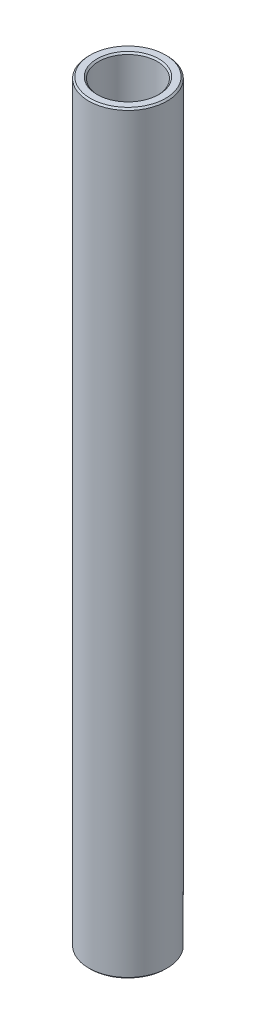
ISO-10303-21;
HEADER;
FILE_DESCRIPTION(('STEP AP214'),'2;1');
FILE_NAME('part.step','',(''),(''),'','','');
FILE_SCHEMA(('AUTOMOTIVE_DESIGN { 1 0 10303 214 1 1 1 1 }'));
ENDSEC;
DATA;
#1=APPLICATION_CONTEXT('core data for automotive mechanical design processes');
#2=APPLICATION_PROTOCOL_DEFINITION('international standard','automotive_design',2000,#1);
#3=PRODUCT_CONTEXT('',#1,'mechanical');
#4=PRODUCT('Part','Part','',(#3));
#5=PRODUCT_RELATED_PRODUCT_CATEGORY('part','',(#4));
#6=PRODUCT_DEFINITION_FORMATION('','',#4);
#7=PRODUCT_DEFINITION_CONTEXT('part definition',#1,'design');
#8=PRODUCT_DEFINITION('design','',#6,#7);
#9=PRODUCT_DEFINITION_SHAPE('','',#8);
#10=(LENGTH_UNIT() NAMED_UNIT(*) SI_UNIT(.MILLI.,.METRE.));
#11=(NAMED_UNIT(*) PLANE_ANGLE_UNIT() SI_UNIT($,.RADIAN.));
#12=(NAMED_UNIT(*) SI_UNIT($,.STERADIAN.) SOLID_ANGLE_UNIT());
#13=UNCERTAINTY_MEASURE_WITH_UNIT(LENGTH_MEASURE(1.E-05),#10,'distance_accuracy_value','');
#14=(GEOMETRIC_REPRESENTATION_CONTEXT(3) GLOBAL_UNCERTAINTY_ASSIGNED_CONTEXT((#13)) GLOBAL_UNIT_ASSIGNED_CONTEXT((#10,
#11,#12)) REPRESENTATION_CONTEXT('',''));
#15=CARTESIAN_POINT('',(0.,0.,0.));
#16=DIRECTION('',(0.,0.,1.));
#17=DIRECTION('',(1.,0.,0.));
#18=AXIS2_PLACEMENT_3D('',#15,#16,#17);
#19=CARTESIAN_POINT('',(65.6040960683433,-438.616598384548,0.));
#20=DIRECTION('',(0.,-1.,0.));
#21=DIRECTION('',(1.,0.,0.));
#22=AXIS2_PLACEMENT_3D('',#19,#20,#21);
#23=PLANE('',#22);
#24=CARTESIAN_POINT('',(59.254096068343,-438.616598384548,0.));
#25=DIRECTION('',(0.,-1.,0.));
#26=DIRECTION('',(1.,0.,0.));
#27=AXIS2_PLACEMENT_3D('',#24,#25,#26);
#28=CIRCLE('',#27,5.0165);
#29=CARTESIAN_POINT('',(64.270596068343,-438.616598384548,0.));
#30=VERTEX_POINT('',#29);
#31=EDGE_CURVE('E10',#30,#30,#28,.F.);
#32=ORIENTED_EDGE('',*,*,#31,.T.);
#33=EDGE_LOOP('',(#32));
#34=FACE_BOUND('',#33,.T.);
#35=CARTESIAN_POINT('',(59.254096068343,-438.616598384548,0.));
#36=DIRECTION('',(0.,-1.,0.));
#37=DIRECTION('',(1.,0.,0.));
#38=AXIS2_PLACEMENT_3D('',#35,#36,#37);
#39=CIRCLE('',#38,6.09600000000033);
#40=CARTESIAN_POINT('',(65.3500960683433,-438.616598384548,0.));
#41=VERTEX_POINT('',#40);
#42=EDGE_CURVE('E38',#41,#41,#39,.T.);
#43=ORIENTED_EDGE('',*,*,#42,.T.);
#44=EDGE_LOOP('',(#43));
#45=FACE_BOUND('',#44,.T.);
#46=ADVANCED_FACE('F31',(#34,#45),#23,.T.);
#47=CARTESIAN_POINT('',(59.254096068343,-448.141598384548,0.));
#48=DIRECTION('',(0.,-1.,0.));
#49=DIRECTION('',(1.,0.,0.));
#50=AXIS2_PLACEMENT_3D('',#47,#48,#49);
#51=CYLINDRICAL_SURFACE('',#50,4.76250000000002);
#52=CARTESIAN_POINT('',(59.254096068343,-316.633098384546,0.));
#53=DIRECTION('',(0.,1.,0.));
#54=DIRECTION('',(0.,0.,1.));
#55=AXIS2_PLACEMENT_3D('',#52,#53,#54);
#56=CIRCLE('',#55,4.76250000000002);
#57=CARTESIAN_POINT('',(59.254096068343,-316.633098384546,4.76250000000002));
#58=VERTEX_POINT('',#57);
#59=EDGE_CURVE('E42',#58,#58,#56,.T.);
#60=ORIENTED_EDGE('',*,*,#59,.T.);
#61=EDGE_LOOP('',(#60));
#62=FACE_BOUND('',#61,.T.);
#63=CARTESIAN_POINT('',(59.254096068343,-438.362598384548,0.));
#64=DIRECTION('',(0.,-1.,0.));
#65=DIRECTION('',(0.,0.,-1.));
#66=AXIS2_PLACEMENT_3D('',#63,#64,#65);
#67=CIRCLE('',#66,4.76250000000002);
#68=CARTESIAN_POINT('',(59.254096068343,-438.362598384548,-4.76250000000002));
#69=VERTEX_POINT('',#68);
#70=EDGE_CURVE('E46',#69,#69,#67,.T.);
#71=ORIENTED_EDGE('',*,*,#70,.T.);
#72=EDGE_LOOP('',(#71));
#73=FACE_BOUND('',#72,.T.);
#74=ADVANCED_FACE('F75',(#62,#73),#51,.F.);
#75=CARTESIAN_POINT('',(64.016596068343,-316.379098384546,0.));
#76=DIRECTION('',(0.,1.,0.));
#77=DIRECTION('',(-1.,0.,0.));
#78=AXIS2_PLACEMENT_3D('',#75,#76,#77);
#79=PLANE('',#78);
#80=CARTESIAN_POINT('',(59.254096068343,-316.379098384546,0.));
#81=DIRECTION('',(0.,1.,0.));
#82=DIRECTION('',(-1.,0.,0.));
#83=AXIS2_PLACEMENT_3D('',#80,#81,#82);
#84=CIRCLE('',#83,6.09600000000031);
#85=CARTESIAN_POINT('',(53.1580960683427,-316.379098384546,0.));
#86=VERTEX_POINT('',#85);
#87=EDGE_CURVE('E51',#86,#86,#84,.T.);
#88=ORIENTED_EDGE('',*,*,#87,.T.);
#89=EDGE_LOOP('',(#88));
#90=FACE_BOUND('',#89,.T.);
#91=CARTESIAN_POINT('',(59.254096068343,-316.379098384546,0.));
#92=DIRECTION('',(0.,1.,0.));
#93=DIRECTION('',(-1.,0.,0.));
#94=AXIS2_PLACEMENT_3D('',#91,#92,#93);
#95=CIRCLE('',#94,5.01649999999999);
#96=CARTESIAN_POINT('',(54.237596068343,-316.379098384546,0.));
#97=VERTEX_POINT('',#96);
#98=EDGE_CURVE('E54',#97,#97,#95,.F.);
#99=ORIENTED_EDGE('',*,*,#98,.T.);
#100=EDGE_LOOP('',(#99));
#101=FACE_BOUND('',#100,.T.);
#102=ADVANCED_FACE('F80',(#90,#101),#79,.T.);
#103=CARTESIAN_POINT('',(59.254096068343,-448.141598384548,0.));
#104=DIRECTION('',(0.,-1.,0.));
#105=DIRECTION('',(1.,0.,0.));
#106=AXIS2_PLACEMENT_3D('',#103,#104,#105);
#107=CYLINDRICAL_SURFACE('',#106,6.35000000000028);
#108=CARTESIAN_POINT('',(59.254096068343,-316.633098384546,0.));
#109=DIRECTION('',(0.,1.,0.));
#110=DIRECTION('',(0.,0.,1.));
#111=AXIS2_PLACEMENT_3D('',#108,#109,#110);
#112=CIRCLE('',#111,6.35000000000028);
#113=CARTESIAN_POINT('',(59.254096068343,-316.633098384546,6.35000000000028));
#114=VERTEX_POINT('',#113);
#115=EDGE_CURVE('E57',#114,#114,#112,.F.);
#116=ORIENTED_EDGE('',*,*,#115,.T.);
#117=EDGE_LOOP('',(#116));
#118=FACE_BOUND('',#117,.T.);
#119=CARTESIAN_POINT('',(59.254096068343,-438.362598384548,0.));
#120=DIRECTION('',(0.,-1.,0.));
#121=DIRECTION('',(0.,0.,-1.));
#122=AXIS2_PLACEMENT_3D('',#119,#120,#121);
#123=CIRCLE('',#122,6.35000000000028);
#124=CARTESIAN_POINT('',(59.254096068343,-438.362598384548,-6.35000000000028));
#125=VERTEX_POINT('',#124);
#126=EDGE_CURVE('E60',#125,#125,#123,.F.);
#127=ORIENTED_EDGE('',*,*,#126,.T.);
#128=EDGE_LOOP('',(#127));
#129=FACE_BOUND('',#128,.T.);
#130=ADVANCED_FACE('F64',(#118,#129),#107,.T.);
#131=CARTESIAN_POINT('',(59.254096068343,-316.633098384546,0.));
#132=DIRECTION('',(0.,-1.,0.));
#133=DIRECTION('',(0.,0.,-1.));
#134=AXIS2_PLACEMENT_3D('',#131,#132,#133);
#135=CONICAL_SURFACE('',#134,6.35000000000028,0.78539816339745);
#136=ORIENTED_EDGE('',*,*,#87,.F.);
#137=EDGE_LOOP('',(#136));
#138=FACE_BOUND('',#137,.T.);
#139=ORIENTED_EDGE('',*,*,#115,.F.);
#140=EDGE_LOOP('',(#139));
#141=FACE_BOUND('',#140,.T.);
#142=ADVANCED_FACE('F85',(#138,#141),#135,.T.);
#143=CARTESIAN_POINT('',(59.254096068343,-316.379098384546,0.));
#144=DIRECTION('',(0.,1.,0.));
#145=DIRECTION('',(0.,0.,1.));
#146=AXIS2_PLACEMENT_3D('',#143,#144,#145);
#147=CONICAL_SURFACE('',#146,5.01649999999999,0.785398163397433);
#148=ORIENTED_EDGE('',*,*,#59,.F.);
#149=EDGE_LOOP('',(#148));
#150=FACE_BOUND('',#149,.T.);
#151=ORIENTED_EDGE('',*,*,#98,.F.);
#152=EDGE_LOOP('',(#151));
#153=FACE_BOUND('',#152,.T.);
#154=ADVANCED_FACE('F72',(#150,#153),#147,.F.);
#155=CARTESIAN_POINT('',(59.254096068343,-438.362598384548,0.));
#156=DIRECTION('',(0.,-1.,0.));
#157=DIRECTION('',(0.,0.,-1.));
#158=AXIS2_PLACEMENT_3D('',#155,#156,#157);
#159=CONICAL_SURFACE('',#158,4.76250000000002,0.78539816339745);
#160=ORIENTED_EDGE('',*,*,#31,.F.);
#161=EDGE_LOOP('',(#160));
#162=FACE_BOUND('',#161,.T.);
#163=ORIENTED_EDGE('',*,*,#70,.F.);
#164=EDGE_LOOP('',(#163));
#165=FACE_BOUND('',#164,.T.);
#166=ADVANCED_FACE('F68',(#162,#165),#159,.F.);
#167=CARTESIAN_POINT('',(59.254096068343,-438.616598384548,0.));
#168=DIRECTION('',(0.,1.,0.));
#169=DIRECTION('',(0.,0.,1.));
#170=AXIS2_PLACEMENT_3D('',#167,#168,#169);
#171=CONICAL_SURFACE('',#170,6.09600000000033,0.785398163397406);
#172=ORIENTED_EDGE('',*,*,#126,.F.);
#173=EDGE_LOOP('',(#172));
#174=FACE_BOUND('',#173,.T.);
#175=ORIENTED_EDGE('',*,*,#42,.F.);
#176=EDGE_LOOP('',(#175));
#177=FACE_BOUND('',#176,.T.);
#178=ADVANCED_FACE('F33',(#174,#177),#171,.T.);
#179=CLOSED_SHELL('',(#46,#74,#102,#130,#142,#154,#166,#178));
#180=MANIFOLD_SOLID_BREP('B2',#179);
#181=ADVANCED_BREP_SHAPE_REPRESENTATION('',(#18,#180),#14);
#182=SHAPE_DEFINITION_REPRESENTATION(#9,#181);
ENDSEC;
END-ISO-10303-21;
